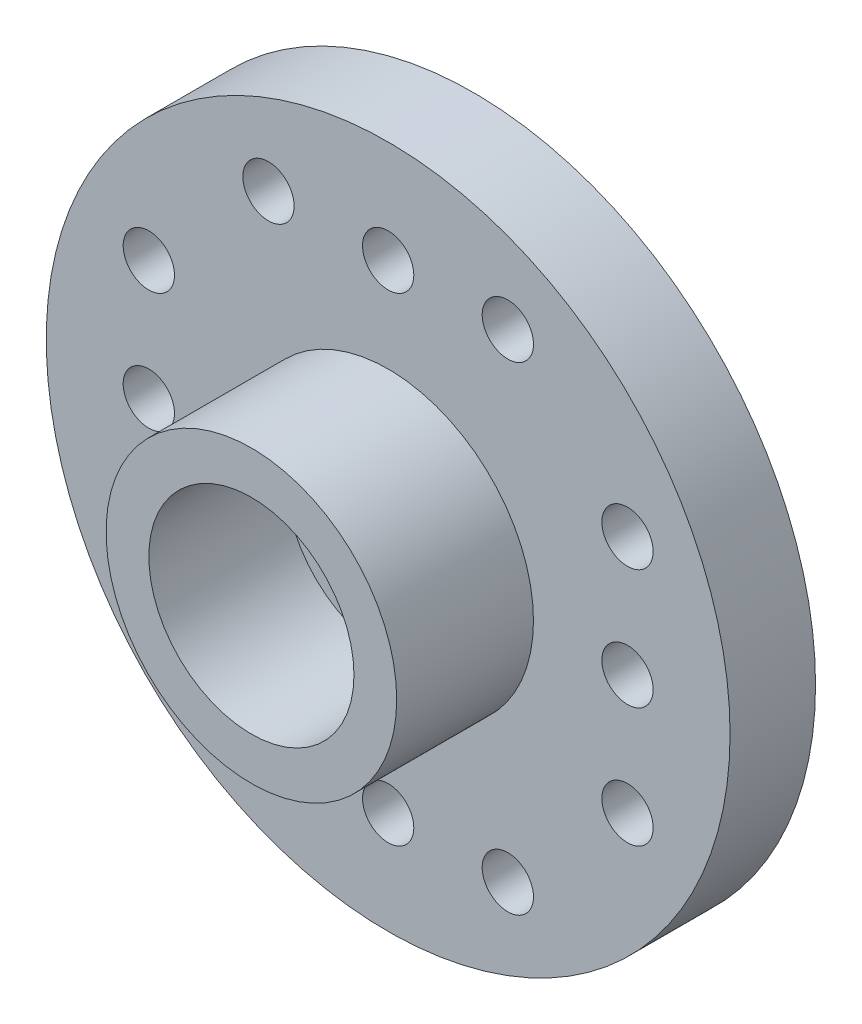
ISO-10303-21;
HEADER;
FILE_DESCRIPTION(('STEP AP214'),'2;1');
FILE_NAME('part.step','',(''),(''),'','','');
FILE_SCHEMA(('AUTOMOTIVE_DESIGN { 1 0 10303 214 1 1 1 1 }'));
ENDSEC;
DATA;
#1=APPLICATION_CONTEXT('core data for automotive mechanical design processes');
#2=APPLICATION_PROTOCOL_DEFINITION('international standard','automotive_design',2000,#1);
#3=PRODUCT_CONTEXT('',#1,'mechanical');
#4=PRODUCT('Part','Part','',(#3));
#5=PRODUCT_RELATED_PRODUCT_CATEGORY('part','',(#4));
#6=PRODUCT_DEFINITION_FORMATION('','',#4);
#7=PRODUCT_DEFINITION_CONTEXT('part definition',#1,'design');
#8=PRODUCT_DEFINITION('design','',#6,#7);
#9=PRODUCT_DEFINITION_SHAPE('','',#8);
#10=(LENGTH_UNIT() NAMED_UNIT(*) SI_UNIT(.MILLI.,.METRE.));
#11=(NAMED_UNIT(*) PLANE_ANGLE_UNIT() SI_UNIT($,.RADIAN.));
#12=(NAMED_UNIT(*) SI_UNIT($,.STERADIAN.) SOLID_ANGLE_UNIT());
#13=UNCERTAINTY_MEASURE_WITH_UNIT(LENGTH_MEASURE(1.E-05),#10,'distance_accuracy_value','');
#14=(GEOMETRIC_REPRESENTATION_CONTEXT(3) GLOBAL_UNCERTAINTY_ASSIGNED_CONTEXT((#13)) GLOBAL_UNIT_ASSIGNED_CONTEXT((#10,
#11,#12)) REPRESENTATION_CONTEXT('',''));
#15=CARTESIAN_POINT('',(0.,0.,0.));
#16=DIRECTION('',(0.,0.,1.));
#17=DIRECTION('',(1.,0.,0.));
#18=AXIS2_PLACEMENT_3D('',#15,#16,#17);
#19=CARTESIAN_POINT('',(0.,0.,2.5));
#20=DIRECTION('',(0.,0.,1.));
#21=DIRECTION('',(1.,0.,0.));
#22=AXIS2_PLACEMENT_3D('',#19,#20,#21);
#23=PLANE('',#22);
#24=CARTESIAN_POINT('',(-7.,3.5,2.5));
#25=DIRECTION('',(0.,0.,1.));
#26=DIRECTION('',(1.,0.,0.));
#27=AXIS2_PLACEMENT_3D('',#24,#25,#26);
#28=CIRCLE('',#27,0.749999999999998);
#29=CARTESIAN_POINT('',(-6.25,3.5,2.5));
#30=VERTEX_POINT('',#29);
#31=EDGE_CURVE('E113',#30,#30,#28,.T.);
#32=ORIENTED_EDGE('',*,*,#31,.F.);
#33=EDGE_LOOP('',(#32));
#34=FACE_BOUND('',#33,.T.);
#35=CARTESIAN_POINT('',(-3.49999999999973,-6.99999999999993,2.5));
#36=DIRECTION('',(0.,0.,1.));
#37=DIRECTION('',(1.,0.,0.));
#38=AXIS2_PLACEMENT_3D('',#35,#36,#37);
#39=CIRCLE('',#38,0.749999999999999);
#40=CARTESIAN_POINT('',(-2.74999999999974,-6.99999999999993,2.5));
#41=VERTEX_POINT('',#40);
#42=EDGE_CURVE('E101',#41,#41,#39,.T.);
#43=ORIENTED_EDGE('',*,*,#42,.F.);
#44=EDGE_LOOP('',(#43));
#45=FACE_BOUND('',#44,.T.);
#46=CARTESIAN_POINT('',(2.65831209225568E-13,-6.99999999999993,2.5));
#47=DIRECTION('',(0.,0.,1.));
#48=DIRECTION('',(1.,0.,0.));
#49=AXIS2_PLACEMENT_3D('',#46,#47,#48);
#50=CIRCLE('',#49,0.749999999999999);
#51=CARTESIAN_POINT('',(0.750000000000265,-6.99999999999993,2.5));
#52=VERTEX_POINT('',#51);
#53=EDGE_CURVE('E89',#52,#52,#50,.T.);
#54=ORIENTED_EDGE('',*,*,#53,.F.);
#55=EDGE_LOOP('',(#54));
#56=FACE_BOUND('',#55,.T.);
#57=CARTESIAN_POINT('',(7.0000000000002,3.50000000000033,2.5));
#58=DIRECTION('',(0.,0.,1.));
#59=DIRECTION('',(1.,0.,0.));
#60=AXIS2_PLACEMENT_3D('',#57,#58,#59);
#61=CIRCLE('',#60,0.749999999999998);
#62=CARTESIAN_POINT('',(7.7500000000002,3.50000000000033,2.5));
#63=VERTEX_POINT('',#62);
#64=EDGE_CURVE('E77',#63,#63,#61,.T.);
#65=ORIENTED_EDGE('',*,*,#64,.F.);
#66=EDGE_LOOP('',(#65));
#67=FACE_BOUND('',#66,.T.);
#68=CARTESIAN_POINT('',(3.49999999999993,7.00000000000027,2.5));
#69=DIRECTION('',(0.,0.,1.));
#70=DIRECTION('',(1.,0.,0.));
#71=AXIS2_PLACEMENT_3D('',#68,#69,#70);
#72=CIRCLE('',#71,0.749999999999999);
#73=CARTESIAN_POINT('',(4.24999999999993,7.00000000000027,2.5));
#74=VERTEX_POINT('',#73);
#75=EDGE_CURVE('E65',#74,#74,#72,.T.);
#76=ORIENTED_EDGE('',*,*,#75,.F.);
#77=EDGE_LOOP('',(#76));
#78=FACE_BOUND('',#77,.T.);
#79=CARTESIAN_POINT('',(0.,7.00000000000026,2.5));
#80=DIRECTION('',(0.,0.,1.));
#81=DIRECTION('',(1.,0.,0.));
#82=AXIS2_PLACEMENT_3D('',#79,#80,#81);
#83=CIRCLE('',#82,0.749999999999999);
#84=CARTESIAN_POINT('',(0.74999999999993,7.00000000000026,2.5));
#85=VERTEX_POINT('',#84);
#86=EDGE_CURVE('E53',#85,#85,#83,.T.);
#87=ORIENTED_EDGE('',*,*,#86,.F.);
#88=EDGE_LOOP('',(#87));
#89=FACE_BOUND('',#88,.T.);
#90=CARTESIAN_POINT('',(0.,0.,2.5));
#91=DIRECTION('',(0.,0.,1.));
#92=DIRECTION('',(1.,0.,0.));
#93=AXIS2_PLACEMENT_3D('',#90,#91,#92);
#94=CIRCLE('',#93,9.99999999999866);
#95=CARTESIAN_POINT('',(9.99999999999866,0.,2.5));
#96=VERTEX_POINT('',#95);
#97=EDGE_CURVE('E39',#96,#96,#94,.T.);
#98=ORIENTED_EDGE('',*,*,#97,.T.);
#99=EDGE_LOOP('',(#98));
#100=FACE_BOUND('',#99,.T.);
#101=CARTESIAN_POINT('',(-7.,0.,2.5));
#102=DIRECTION('',(0.,0.,1.));
#103=DIRECTION('',(1.,0.,0.));
#104=AXIS2_PLACEMENT_3D('',#101,#102,#103);
#105=CIRCLE('',#104,0.749999999999998);
#106=CARTESIAN_POINT('',(-6.25,0.,2.5));
#107=VERTEX_POINT('',#106);
#108=EDGE_CURVE('E48',#107,#107,#105,.T.);
#109=ORIENTED_EDGE('',*,*,#108,.F.);
#110=EDGE_LOOP('',(#109));
#111=FACE_BOUND('',#110,.T.);
#112=CARTESIAN_POINT('',(-3.50000000000007,7.00000000000027,2.5));
#113=DIRECTION('',(0.,0.,1.));
#114=DIRECTION('',(1.,0.,0.));
#115=AXIS2_PLACEMENT_3D('',#112,#113,#114);
#116=CIRCLE('',#115,0.749999999999998);
#117=CARTESIAN_POINT('',(-2.75000000000007,7.00000000000027,2.5));
#118=VERTEX_POINT('',#117);
#119=EDGE_CURVE('E59',#118,#118,#116,.T.);
#120=ORIENTED_EDGE('',*,*,#119,.F.);
#121=EDGE_LOOP('',(#120));
#122=FACE_BOUND('',#121,.T.);
#123=CARTESIAN_POINT('',(7.0000000000002,3.3392416014695E-13,2.5));
#124=DIRECTION('',(0.,0.,1.));
#125=DIRECTION('',(1.,0.,0.));
#126=AXIS2_PLACEMENT_3D('',#123,#124,#125);
#127=CIRCLE('',#126,0.749999999999999);
#128=CARTESIAN_POINT('',(7.7500000000002,3.3392416014695E-13,2.5));
#129=VERTEX_POINT('',#128);
#130=EDGE_CURVE('E71',#129,#129,#127,.T.);
#131=ORIENTED_EDGE('',*,*,#130,.F.);
#132=EDGE_LOOP('',(#131));
#133=FACE_BOUND('',#132,.T.);
#134=CARTESIAN_POINT('',(7.0000000000002,-3.49999999999967,2.5));
#135=DIRECTION('',(0.,0.,1.));
#136=DIRECTION('',(1.,0.,0.));
#137=AXIS2_PLACEMENT_3D('',#134,#135,#136);
#138=CIRCLE('',#137,0.749999999999998);
#139=CARTESIAN_POINT('',(7.7500000000002,-3.49999999999967,2.5));
#140=VERTEX_POINT('',#139);
#141=EDGE_CURVE('E83',#140,#140,#138,.T.);
#142=ORIENTED_EDGE('',*,*,#141,.F.);
#143=EDGE_LOOP('',(#142));
#144=FACE_BOUND('',#143,.T.);
#145=CARTESIAN_POINT('',(3.50000000000027,-6.99999999999993,2.5));
#146=DIRECTION('',(0.,0.,1.));
#147=DIRECTION('',(1.,0.,0.));
#148=AXIS2_PLACEMENT_3D('',#145,#146,#147);
#149=CIRCLE('',#148,0.749999999999998);
#150=CARTESIAN_POINT('',(4.25000000000026,-6.99999999999993,2.5));
#151=VERTEX_POINT('',#150);
#152=EDGE_CURVE('E95',#151,#151,#149,.T.);
#153=ORIENTED_EDGE('',*,*,#152,.F.);
#154=EDGE_LOOP('',(#153));
#155=FACE_BOUND('',#154,.T.);
#156=CARTESIAN_POINT('',(-7.,-3.5,2.5));
#157=DIRECTION('',(0.,0.,1.));
#158=DIRECTION('',(1.,0.,0.));
#159=AXIS2_PLACEMENT_3D('',#156,#157,#158);
#160=CIRCLE('',#159,0.749999999999998);
#161=CARTESIAN_POINT('',(-6.25,-3.5,2.5));
#162=VERTEX_POINT('',#161);
#163=EDGE_CURVE('E107',#162,#162,#160,.T.);
#164=ORIENTED_EDGE('',*,*,#163,.F.);
#165=EDGE_LOOP('',(#164));
#166=FACE_BOUND('',#165,.T.);
#167=CARTESIAN_POINT('',(0.,0.,2.5));
#168=DIRECTION('',(0.,0.,1.));
#169=DIRECTION('',(1.,0.,0.));
#170=AXIS2_PLACEMENT_3D('',#167,#168,#169);
#171=CIRCLE('',#170,4.25);
#172=CARTESIAN_POINT('',(4.25,0.,2.5));
#173=VERTEX_POINT('',#172);
#174=EDGE_CURVE('E128',#173,#173,#171,.T.);
#175=ORIENTED_EDGE('',*,*,#174,.F.);
#176=EDGE_LOOP('',(#175));
#177=FACE_BOUND('',#176,.T.);
#178=ADVANCED_FACE('F32',(#34,#45,#56,#67,#78,#89,#100,#111,#122,#133,#144,#155,#166,#177),#23,.T.);
#179=CARTESIAN_POINT('',(0.,0.,2.5));
#180=DIRECTION('',(0.,0.,1.));
#181=DIRECTION('',(1.,0.,0.));
#182=AXIS2_PLACEMENT_3D('',#179,#180,#181);
#183=CIRCLE('',#182,3.);
#184=CARTESIAN_POINT('',(3.,0.,2.5));
#185=VERTEX_POINT('',#184);
#186=EDGE_CURVE('E10',#185,#185,#183,.F.);
#187=ORIENTED_EDGE('',*,*,#186,.F.);
#188=EDGE_LOOP('',(#187));
#189=FACE_BOUND('',#188,.T.);
#190=CARTESIAN_POINT('',(0.,0.,2.5));
#191=DIRECTION('',(0.,0.,1.));
#192=DIRECTION('',(1.,0.,0.));
#193=AXIS2_PLACEMENT_3D('',#190,#191,#192);
#194=CIRCLE('',#193,1.5);
#195=CARTESIAN_POINT('',(1.5,0.,2.5));
#196=VERTEX_POINT('',#195);
#197=EDGE_CURVE('E119',#196,#196,#194,.T.);
#198=ORIENTED_EDGE('',*,*,#197,.F.);
#199=EDGE_LOOP('',(#198));
#200=FACE_BOUND('',#199,.T.);
#201=ADVANCED_FACE('F156',(#189,#200),#23,.T.);
#202=CARTESIAN_POINT('',(0.,0.,0.));
#203=DIRECTION('',(0.,0.,1.));
#204=DIRECTION('',(1.,0.,0.));
#205=AXIS2_PLACEMENT_3D('',#202,#203,#204);
#206=PLANE('',#205);
#207=CARTESIAN_POINT('',(-7.,3.5,0.));
#208=DIRECTION('',(0.,0.,1.));
#209=DIRECTION('',(1.,0.,0.));
#210=AXIS2_PLACEMENT_3D('',#207,#208,#209);
#211=CIRCLE('',#210,0.749999999999998);
#212=CARTESIAN_POINT('',(-6.25,3.5,0.));
#213=VERTEX_POINT('',#212);
#214=EDGE_CURVE('E116',#213,#213,#211,.T.);
#215=ORIENTED_EDGE('',*,*,#214,.T.);
#216=EDGE_LOOP('',(#215));
#217=FACE_BOUND('',#216,.T.);
#218=CARTESIAN_POINT('',(-3.49999999999973,-6.99999999999993,0.));
#219=DIRECTION('',(0.,0.,1.));
#220=DIRECTION('',(1.,0.,0.));
#221=AXIS2_PLACEMENT_3D('',#218,#219,#220);
#222=CIRCLE('',#221,0.749999999999999);
#223=CARTESIAN_POINT('',(-2.74999999999974,-6.99999999999993,0.));
#224=VERTEX_POINT('',#223);
#225=EDGE_CURVE('E104',#224,#224,#222,.T.);
#226=ORIENTED_EDGE('',*,*,#225,.T.);
#227=EDGE_LOOP('',(#226));
#228=FACE_BOUND('',#227,.T.);
#229=CARTESIAN_POINT('',(2.65831209225568E-13,-6.99999999999993,0.));
#230=DIRECTION('',(0.,0.,1.));
#231=DIRECTION('',(1.,0.,0.));
#232=AXIS2_PLACEMENT_3D('',#229,#230,#231);
#233=CIRCLE('',#232,0.749999999999999);
#234=CARTESIAN_POINT('',(0.750000000000265,-6.99999999999993,0.));
#235=VERTEX_POINT('',#234);
#236=EDGE_CURVE('E92',#235,#235,#233,.T.);
#237=ORIENTED_EDGE('',*,*,#236,.T.);
#238=EDGE_LOOP('',(#237));
#239=FACE_BOUND('',#238,.T.);
#240=CARTESIAN_POINT('',(7.0000000000002,3.50000000000033,0.));
#241=DIRECTION('',(0.,0.,1.));
#242=DIRECTION('',(1.,0.,0.));
#243=AXIS2_PLACEMENT_3D('',#240,#241,#242);
#244=CIRCLE('',#243,0.749999999999998);
#245=CARTESIAN_POINT('',(7.7500000000002,3.50000000000033,0.));
#246=VERTEX_POINT('',#245);
#247=EDGE_CURVE('E80',#246,#246,#244,.T.);
#248=ORIENTED_EDGE('',*,*,#247,.T.);
#249=EDGE_LOOP('',(#248));
#250=FACE_BOUND('',#249,.T.);
#251=CARTESIAN_POINT('',(3.49999999999993,7.00000000000027,0.));
#252=DIRECTION('',(0.,0.,1.));
#253=DIRECTION('',(1.,0.,0.));
#254=AXIS2_PLACEMENT_3D('',#251,#252,#253);
#255=CIRCLE('',#254,0.749999999999999);
#256=CARTESIAN_POINT('',(4.24999999999993,7.00000000000027,0.));
#257=VERTEX_POINT('',#256);
#258=EDGE_CURVE('E68',#257,#257,#255,.T.);
#259=ORIENTED_EDGE('',*,*,#258,.T.);
#260=EDGE_LOOP('',(#259));
#261=FACE_BOUND('',#260,.T.);
#262=CARTESIAN_POINT('',(0.,7.00000000000026,0.));
#263=DIRECTION('',(0.,0.,1.));
#264=DIRECTION('',(1.,0.,0.));
#265=AXIS2_PLACEMENT_3D('',#262,#263,#264);
#266=CIRCLE('',#265,0.749999999999999);
#267=CARTESIAN_POINT('',(0.74999999999993,7.00000000000026,0.));
#268=VERTEX_POINT('',#267);
#269=EDGE_CURVE('E56',#268,#268,#266,.T.);
#270=ORIENTED_EDGE('',*,*,#269,.T.);
#271=EDGE_LOOP('',(#270));
#272=FACE_BOUND('',#271,.T.);
#273=CARTESIAN_POINT('',(0.,0.,0.));
#274=DIRECTION('',(0.,0.,1.));
#275=DIRECTION('',(1.,0.,0.));
#276=AXIS2_PLACEMENT_3D('',#273,#274,#275);
#277=CIRCLE('',#276,9.99999999999866);
#278=CARTESIAN_POINT('',(9.99999999999866,0.,0.));
#279=VERTEX_POINT('',#278);
#280=EDGE_CURVE('E43',#279,#279,#277,.T.);
#281=ORIENTED_EDGE('',*,*,#280,.F.);
#282=EDGE_LOOP('',(#281));
#283=FACE_BOUND('',#282,.T.);
#284=CARTESIAN_POINT('',(-7.,0.,0.));
#285=DIRECTION('',(0.,0.,1.));
#286=DIRECTION('',(1.,0.,0.));
#287=AXIS2_PLACEMENT_3D('',#284,#285,#286);
#288=CIRCLE('',#287,0.749999999999998);
#289=CARTESIAN_POINT('',(-6.25,0.,0.));
#290=VERTEX_POINT('',#289);
#291=EDGE_CURVE('E50',#290,#290,#288,.T.);
#292=ORIENTED_EDGE('',*,*,#291,.T.);
#293=EDGE_LOOP('',(#292));
#294=FACE_BOUND('',#293,.T.);
#295=CARTESIAN_POINT('',(-3.50000000000007,7.00000000000027,0.));
#296=DIRECTION('',(0.,0.,1.));
#297=DIRECTION('',(1.,0.,0.));
#298=AXIS2_PLACEMENT_3D('',#295,#296,#297);
#299=CIRCLE('',#298,0.749999999999998);
#300=CARTESIAN_POINT('',(-2.75000000000007,7.00000000000027,0.));
#301=VERTEX_POINT('',#300);
#302=EDGE_CURVE('E62',#301,#301,#299,.T.);
#303=ORIENTED_EDGE('',*,*,#302,.T.);
#304=EDGE_LOOP('',(#303));
#305=FACE_BOUND('',#304,.T.);
#306=CARTESIAN_POINT('',(7.0000000000002,3.3392416014695E-13,0.));
#307=DIRECTION('',(0.,0.,1.));
#308=DIRECTION('',(1.,0.,0.));
#309=AXIS2_PLACEMENT_3D('',#306,#307,#308);
#310=CIRCLE('',#309,0.749999999999999);
#311=CARTESIAN_POINT('',(7.7500000000002,3.3392416014695E-13,0.));
#312=VERTEX_POINT('',#311);
#313=EDGE_CURVE('E74',#312,#312,#310,.T.);
#314=ORIENTED_EDGE('',*,*,#313,.T.);
#315=EDGE_LOOP('',(#314));
#316=FACE_BOUND('',#315,.T.);
#317=CARTESIAN_POINT('',(7.0000000000002,-3.49999999999967,0.));
#318=DIRECTION('',(0.,0.,1.));
#319=DIRECTION('',(1.,0.,0.));
#320=AXIS2_PLACEMENT_3D('',#317,#318,#319);
#321=CIRCLE('',#320,0.749999999999998);
#322=CARTESIAN_POINT('',(7.7500000000002,-3.49999999999967,0.));
#323=VERTEX_POINT('',#322);
#324=EDGE_CURVE('E86',#323,#323,#321,.T.);
#325=ORIENTED_EDGE('',*,*,#324,.T.);
#326=EDGE_LOOP('',(#325));
#327=FACE_BOUND('',#326,.T.);
#328=CARTESIAN_POINT('',(3.50000000000027,-6.99999999999993,0.));
#329=DIRECTION('',(0.,0.,1.));
#330=DIRECTION('',(1.,0.,0.));
#331=AXIS2_PLACEMENT_3D('',#328,#329,#330);
#332=CIRCLE('',#331,0.749999999999998);
#333=CARTESIAN_POINT('',(4.25000000000026,-6.99999999999993,0.));
#334=VERTEX_POINT('',#333);
#335=EDGE_CURVE('E98',#334,#334,#332,.T.);
#336=ORIENTED_EDGE('',*,*,#335,.T.);
#337=EDGE_LOOP('',(#336));
#338=FACE_BOUND('',#337,.T.);
#339=CARTESIAN_POINT('',(-7.,-3.5,0.));
#340=DIRECTION('',(0.,0.,1.));
#341=DIRECTION('',(1.,0.,0.));
#342=AXIS2_PLACEMENT_3D('',#339,#340,#341);
#343=CIRCLE('',#342,0.749999999999998);
#344=CARTESIAN_POINT('',(-6.25,-3.5,0.));
#345=VERTEX_POINT('',#344);
#346=EDGE_CURVE('E110',#345,#345,#343,.T.);
#347=ORIENTED_EDGE('',*,*,#346,.T.);
#348=EDGE_LOOP('',(#347));
#349=FACE_BOUND('',#348,.T.);
#350=CARTESIAN_POINT('',(0.,0.,0.));
#351=DIRECTION('',(0.,0.,1.));
#352=DIRECTION('',(1.,0.,0.));
#353=AXIS2_PLACEMENT_3D('',#350,#351,#352);
#354=CIRCLE('',#353,1.5);
#355=CARTESIAN_POINT('',(1.5,0.,0.));
#356=VERTEX_POINT('',#355);
#357=EDGE_CURVE('E122',#356,#356,#354,.T.);
#358=ORIENTED_EDGE('',*,*,#357,.T.);
#359=EDGE_LOOP('',(#358));
#360=FACE_BOUND('',#359,.T.);
#361=ADVANCED_FACE('F162',(#217,#228,#239,#250,#261,#272,#283,#294,#305,#316,#327,#338,#349,
#360),#206,.F.);
#362=CARTESIAN_POINT('',(0.,0.,2.5));
#363=DIRECTION('',(0.,0.,-1.));
#364=DIRECTION('',(-1.,0.,0.));
#365=AXIS2_PLACEMENT_3D('',#362,#363,#364);
#366=CYLINDRICAL_SURFACE('',#365,9.99999999999866);
#367=ORIENTED_EDGE('',*,*,#97,.F.);
#368=EDGE_LOOP('',(#367));
#369=FACE_BOUND('',#368,.T.);
#370=ORIENTED_EDGE('',*,*,#280,.T.);
#371=EDGE_LOOP('',(#370));
#372=FACE_BOUND('',#371,.T.);
#373=ADVANCED_FACE('F34',(#369,#372),#366,.T.);
#374=CARTESIAN_POINT('',(-7.,0.,2.5));
#375=DIRECTION('',(0.,0.,-1.));
#376=DIRECTION('',(-1.,0.,0.));
#377=AXIS2_PLACEMENT_3D('',#374,#375,#376);
#378=CYLINDRICAL_SURFACE('',#377,0.749999999999998);
#379=ORIENTED_EDGE('',*,*,#108,.T.);
#380=EDGE_LOOP('',(#379));
#381=FACE_BOUND('',#380,.T.);
#382=ORIENTED_EDGE('',*,*,#291,.F.);
#383=EDGE_LOOP('',(#382));
#384=FACE_BOUND('',#383,.T.);
#385=ADVANCED_FACE('F167',(#381,#384),#378,.F.);
#386=CARTESIAN_POINT('',(0.,7.00000000000026,2.5));
#387=DIRECTION('',(0.,0.,-1.));
#388=DIRECTION('',(-1.,0.,0.));
#389=AXIS2_PLACEMENT_3D('',#386,#387,#388);
#390=CYLINDRICAL_SURFACE('',#389,0.749999999999999);
#391=ORIENTED_EDGE('',*,*,#86,.T.);
#392=EDGE_LOOP('',(#391));
#393=FACE_BOUND('',#392,.T.);
#394=ORIENTED_EDGE('',*,*,#269,.F.);
#395=EDGE_LOOP('',(#394));
#396=FACE_BOUND('',#395,.T.);
#397=ADVANCED_FACE('F244',(#393,#396),#390,.F.);
#398=CARTESIAN_POINT('',(-3.50000000000007,7.00000000000027,2.5));
#399=DIRECTION('',(0.,0.,-1.));
#400=DIRECTION('',(-1.,0.,0.));
#401=AXIS2_PLACEMENT_3D('',#398,#399,#400);
#402=CYLINDRICAL_SURFACE('',#401,0.749999999999998);
#403=ORIENTED_EDGE('',*,*,#119,.T.);
#404=EDGE_LOOP('',(#403));
#405=FACE_BOUND('',#404,.T.);
#406=ORIENTED_EDGE('',*,*,#302,.F.);
#407=EDGE_LOOP('',(#406));
#408=FACE_BOUND('',#407,.T.);
#409=ADVANCED_FACE('F241',(#405,#408),#402,.F.);
#410=CARTESIAN_POINT('',(3.49999999999993,7.00000000000027,2.5));
#411=DIRECTION('',(0.,0.,-1.));
#412=DIRECTION('',(-1.,0.,0.));
#413=AXIS2_PLACEMENT_3D('',#410,#411,#412);
#414=CYLINDRICAL_SURFACE('',#413,0.749999999999999);
#415=ORIENTED_EDGE('',*,*,#75,.T.);
#416=EDGE_LOOP('',(#415));
#417=FACE_BOUND('',#416,.T.);
#418=ORIENTED_EDGE('',*,*,#258,.F.);
#419=EDGE_LOOP('',(#418));
#420=FACE_BOUND('',#419,.T.);
#421=ADVANCED_FACE('F237',(#417,#420),#414,.F.);
#422=CARTESIAN_POINT('',(7.0000000000002,3.3392416014695E-13,2.5));
#423=DIRECTION('',(0.,0.,-1.));
#424=DIRECTION('',(-1.,0.,0.));
#425=AXIS2_PLACEMENT_3D('',#422,#423,#424);
#426=CYLINDRICAL_SURFACE('',#425,0.749999999999999);
#427=ORIENTED_EDGE('',*,*,#130,.T.);
#428=EDGE_LOOP('',(#427));
#429=FACE_BOUND('',#428,.T.);
#430=ORIENTED_EDGE('',*,*,#313,.F.);
#431=EDGE_LOOP('',(#430));
#432=FACE_BOUND('',#431,.T.);
#433=ADVANCED_FACE('F233',(#429,#432),#426,.F.);
#434=CARTESIAN_POINT('',(7.0000000000002,3.50000000000033,2.5));
#435=DIRECTION('',(0.,0.,-1.));
#436=DIRECTION('',(-1.,0.,0.));
#437=AXIS2_PLACEMENT_3D('',#434,#435,#436);
#438=CYLINDRICAL_SURFACE('',#437,0.749999999999998);
#439=ORIENTED_EDGE('',*,*,#64,.T.);
#440=EDGE_LOOP('',(#439));
#441=FACE_BOUND('',#440,.T.);
#442=ORIENTED_EDGE('',*,*,#247,.F.);
#443=EDGE_LOOP('',(#442));
#444=FACE_BOUND('',#443,.T.);
#445=ADVANCED_FACE('F229',(#441,#444),#438,.F.);
#446=CARTESIAN_POINT('',(7.0000000000002,-3.49999999999967,2.5));
#447=DIRECTION('',(0.,0.,-1.));
#448=DIRECTION('',(-1.,0.,0.));
#449=AXIS2_PLACEMENT_3D('',#446,#447,#448);
#450=CYLINDRICAL_SURFACE('',#449,0.749999999999998);
#451=ORIENTED_EDGE('',*,*,#141,.T.);
#452=EDGE_LOOP('',(#451));
#453=FACE_BOUND('',#452,.T.);
#454=ORIENTED_EDGE('',*,*,#324,.F.);
#455=EDGE_LOOP('',(#454));
#456=FACE_BOUND('',#455,.T.);
#457=ADVANCED_FACE('F225',(#453,#456),#450,.F.);
#458=CARTESIAN_POINT('',(2.65831209225568E-13,-6.99999999999993,2.5));
#459=DIRECTION('',(0.,0.,-1.));
#460=DIRECTION('',(-1.,0.,0.));
#461=AXIS2_PLACEMENT_3D('',#458,#459,#460);
#462=CYLINDRICAL_SURFACE('',#461,0.749999999999999);
#463=ORIENTED_EDGE('',*,*,#53,.T.);
#464=EDGE_LOOP('',(#463));
#465=FACE_BOUND('',#464,.T.);
#466=ORIENTED_EDGE('',*,*,#236,.F.);
#467=EDGE_LOOP('',(#466));
#468=FACE_BOUND('',#467,.T.);
#469=ADVANCED_FACE('F221',(#465,#468),#462,.F.);
#470=CARTESIAN_POINT('',(3.50000000000027,-6.99999999999993,2.5));
#471=DIRECTION('',(0.,0.,-1.));
#472=DIRECTION('',(-1.,0.,0.));
#473=AXIS2_PLACEMENT_3D('',#470,#471,#472);
#474=CYLINDRICAL_SURFACE('',#473,0.749999999999998);
#475=ORIENTED_EDGE('',*,*,#152,.T.);
#476=EDGE_LOOP('',(#475));
#477=FACE_BOUND('',#476,.T.);
#478=ORIENTED_EDGE('',*,*,#335,.F.);
#479=EDGE_LOOP('',(#478));
#480=FACE_BOUND('',#479,.T.);
#481=ADVANCED_FACE('F215',(#477,#480),#474,.F.);
#482=CARTESIAN_POINT('',(-3.49999999999973,-6.99999999999993,2.5));
#483=DIRECTION('',(0.,0.,-1.));
#484=DIRECTION('',(-1.,0.,0.));
#485=AXIS2_PLACEMENT_3D('',#482,#483,#484);
#486=CYLINDRICAL_SURFACE('',#485,0.749999999999999);
#487=ORIENTED_EDGE('',*,*,#42,.T.);
#488=EDGE_LOOP('',(#487));
#489=FACE_BOUND('',#488,.T.);
#490=ORIENTED_EDGE('',*,*,#225,.F.);
#491=EDGE_LOOP('',(#490));
#492=FACE_BOUND('',#491,.T.);
#493=ADVANCED_FACE('F206',(#489,#492),#486,.F.);
#494=CARTESIAN_POINT('',(-7.,-3.5,2.5));
#495=DIRECTION('',(0.,0.,-1.));
#496=DIRECTION('',(-1.,0.,0.));
#497=AXIS2_PLACEMENT_3D('',#494,#495,#496);
#498=CYLINDRICAL_SURFACE('',#497,0.749999999999998);
#499=ORIENTED_EDGE('',*,*,#163,.T.);
#500=EDGE_LOOP('',(#499));
#501=FACE_BOUND('',#500,.T.);
#502=ORIENTED_EDGE('',*,*,#346,.F.);
#503=EDGE_LOOP('',(#502));
#504=FACE_BOUND('',#503,.T.);
#505=ADVANCED_FACE('F204',(#501,#504),#498,.F.);
#506=CARTESIAN_POINT('',(-7.,3.5,2.5));
#507=DIRECTION('',(0.,0.,-1.));
#508=DIRECTION('',(-1.,0.,0.));
#509=AXIS2_PLACEMENT_3D('',#506,#507,#508);
#510=CYLINDRICAL_SURFACE('',#509,0.749999999999998);
#511=ORIENTED_EDGE('',*,*,#31,.T.);
#512=EDGE_LOOP('',(#511));
#513=FACE_BOUND('',#512,.T.);
#514=ORIENTED_EDGE('',*,*,#214,.F.);
#515=EDGE_LOOP('',(#514));
#516=FACE_BOUND('',#515,.T.);
#517=ADVANCED_FACE('F151',(#513,#516),#510,.F.);
#518=CARTESIAN_POINT('',(0.,0.,2.5));
#519=DIRECTION('',(0.,0.,-1.));
#520=DIRECTION('',(-1.,0.,0.));
#521=AXIS2_PLACEMENT_3D('',#518,#519,#520);
#522=CYLINDRICAL_SURFACE('',#521,1.5);
#523=ORIENTED_EDGE('',*,*,#197,.T.);
#524=EDGE_LOOP('',(#523));
#525=FACE_BOUND('',#524,.T.);
#526=ORIENTED_EDGE('',*,*,#357,.F.);
#527=EDGE_LOOP('',(#526));
#528=FACE_BOUND('',#527,.T.);
#529=ADVANCED_FACE('F142',(#525,#528),#522,.F.);
#530=CARTESIAN_POINT('',(0.,0.,6.5));
#531=DIRECTION('',(0.,0.,1.));
#532=DIRECTION('',(1.,0.,0.));
#533=AXIS2_PLACEMENT_3D('',#530,#531,#532);
#534=PLANE('',#533);
#535=CARTESIAN_POINT('',(0.,0.,6.5));
#536=DIRECTION('',(0.,0.,1.));
#537=DIRECTION('',(1.,0.,0.));
#538=AXIS2_PLACEMENT_3D('',#535,#536,#537);
#539=CIRCLE('',#538,4.25);
#540=CARTESIAN_POINT('',(4.25,0.,6.5));
#541=VERTEX_POINT('',#540);
#542=EDGE_CURVE('E125',#541,#541,#539,.T.);
#543=ORIENTED_EDGE('',*,*,#542,.T.);
#544=EDGE_LOOP('',(#543));
#545=FACE_BOUND('',#544,.T.);
#546=CARTESIAN_POINT('',(0.,0.,6.5));
#547=DIRECTION('',(0.,0.,1.));
#548=DIRECTION('',(1.,0.,0.));
#549=AXIS2_PLACEMENT_3D('',#546,#547,#548);
#550=CIRCLE('',#549,3.);
#551=CARTESIAN_POINT('',(3.,0.,6.5));
#552=VERTEX_POINT('',#551);
#553=EDGE_CURVE('E131',#552,#552,#550,.T.);
#554=ORIENTED_EDGE('',*,*,#553,.F.);
#555=EDGE_LOOP('',(#554));
#556=FACE_BOUND('',#555,.T.);
#557=ADVANCED_FACE('F139',(#545,#556),#534,.T.);
#558=CARTESIAN_POINT('',(0.,0.,6.5));
#559=DIRECTION('',(0.,0.,-1.));
#560=DIRECTION('',(-1.,0.,0.));
#561=AXIS2_PLACEMENT_3D('',#558,#559,#560);
#562=CYLINDRICAL_SURFACE('',#561,4.25);
#563=ORIENTED_EDGE('',*,*,#542,.F.);
#564=EDGE_LOOP('',(#563));
#565=FACE_BOUND('',#564,.T.);
#566=ORIENTED_EDGE('',*,*,#174,.T.);
#567=EDGE_LOOP('',(#566));
#568=FACE_BOUND('',#567,.T.);
#569=ADVANCED_FACE('F141',(#565,#568),#562,.T.);
#570=CARTESIAN_POINT('',(0.,0.,6.5));
#571=DIRECTION('',(0.,0.,-1.));
#572=DIRECTION('',(-1.,0.,0.));
#573=AXIS2_PLACEMENT_3D('',#570,#571,#572);
#574=CYLINDRICAL_SURFACE('',#573,3.);
#575=ORIENTED_EDGE('',*,*,#553,.T.);
#576=EDGE_LOOP('',(#575));
#577=FACE_BOUND('',#576,.T.);
#578=ORIENTED_EDGE('',*,*,#186,.T.);
#579=EDGE_LOOP('',(#578));
#580=FACE_BOUND('',#579,.T.);
#581=ADVANCED_FACE('F137',(#577,#580),#574,.F.);
#582=CLOSED_SHELL('',(#178,#201,#361,#373,#385,#397,#409,#421,#433,#445,#457,#469,#481,#493,
#505,#517,#529,#557,#569,#581));
#583=MANIFOLD_SOLID_BREP('B2',#582);
#584=ADVANCED_BREP_SHAPE_REPRESENTATION('',(#18,#583),#14);
#585=SHAPE_DEFINITION_REPRESENTATION(#9,#584);
ENDSEC;
END-ISO-10303-21;
